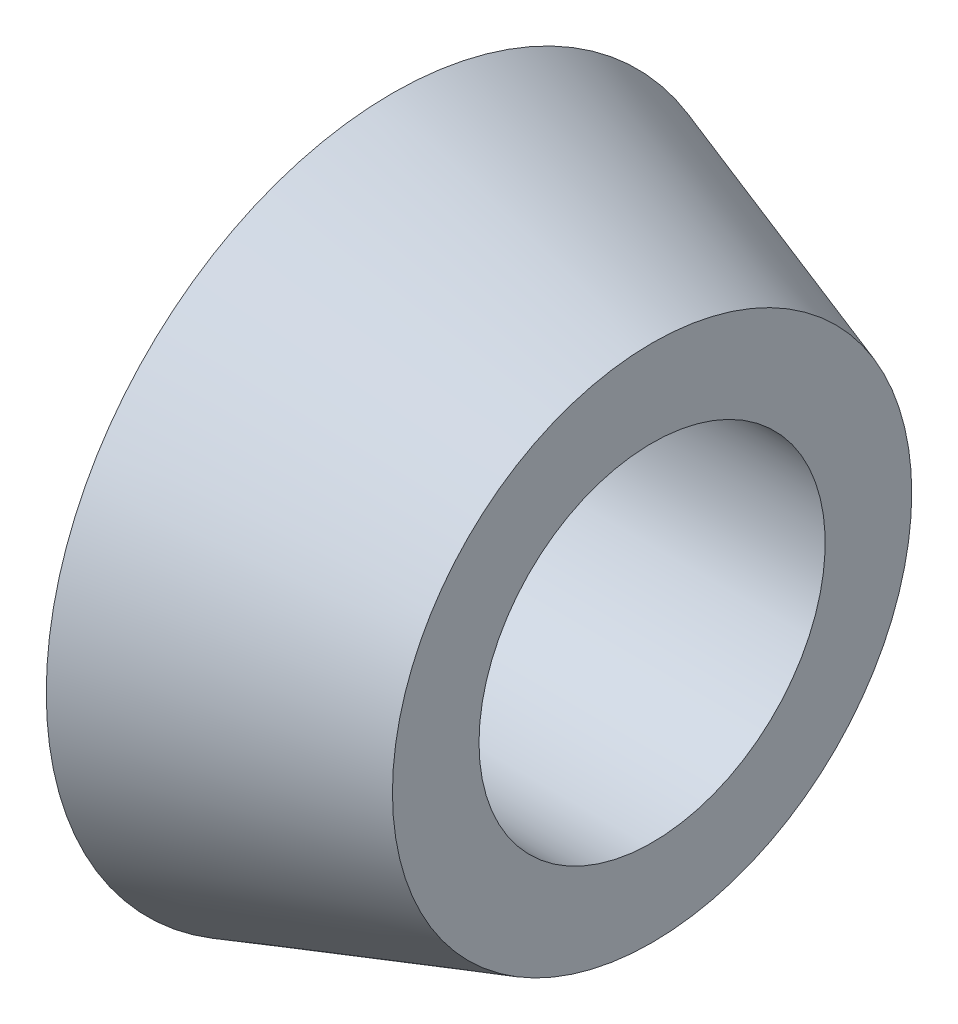
ISO-10303-21;
HEADER;
FILE_DESCRIPTION(('STEP AP214'),'2;1');
FILE_NAME('part.step','',(''),(''),'','','');
FILE_SCHEMA(('AUTOMOTIVE_DESIGN { 1 0 10303 214 1 1 1 1 }'));
ENDSEC;
DATA;
#1=APPLICATION_CONTEXT('core data for automotive mechanical design processes');
#2=APPLICATION_PROTOCOL_DEFINITION('international standard','automotive_design',2000,#1);
#3=PRODUCT_CONTEXT('',#1,'mechanical');
#4=PRODUCT('Part','Part','',(#3));
#5=PRODUCT_RELATED_PRODUCT_CATEGORY('part','',(#4));
#6=PRODUCT_DEFINITION_FORMATION('','',#4);
#7=PRODUCT_DEFINITION_CONTEXT('part definition',#1,'design');
#8=PRODUCT_DEFINITION('design','',#6,#7);
#9=PRODUCT_DEFINITION_SHAPE('','',#8);
#10=(LENGTH_UNIT() NAMED_UNIT(*) SI_UNIT(.MILLI.,.METRE.));
#11=(NAMED_UNIT(*) PLANE_ANGLE_UNIT() SI_UNIT($,.RADIAN.));
#12=(NAMED_UNIT(*) SI_UNIT($,.STERADIAN.) SOLID_ANGLE_UNIT());
#13=UNCERTAINTY_MEASURE_WITH_UNIT(LENGTH_MEASURE(1.E-05),#10,'distance_accuracy_value','');
#14=(GEOMETRIC_REPRESENTATION_CONTEXT(3) GLOBAL_UNCERTAINTY_ASSIGNED_CONTEXT((#13)) GLOBAL_UNIT_ASSIGNED_CONTEXT((#10,
#11,#12)) REPRESENTATION_CONTEXT('',''));
#15=CARTESIAN_POINT('',(0.,0.,0.));
#16=DIRECTION('',(0.,0.,1.));
#17=DIRECTION('',(1.,0.,0.));
#18=AXIS2_PLACEMENT_3D('',#15,#16,#17);
#19=CARTESIAN_POINT('',(0.,6.,0.));
#20=DIRECTION('',(1.,0.,0.));
#21=DIRECTION('',(0.,0.,-1.));
#22=AXIS2_PLACEMENT_3D('',#19,#20,#21);
#23=PLANE('',#22);
#24=CARTESIAN_POINT('',(0.,0.,0.));
#25=DIRECTION('',(-1.,0.,0.));
#26=DIRECTION('',(0.,0.,1.));
#27=AXIS2_PLACEMENT_3D('',#24,#25,#26);
#28=CIRCLE('',#27,3.);
#29=CARTESIAN_POINT('',(0.,0.,3.));
#30=VERTEX_POINT('',#29);
#31=EDGE_CURVE('E10',#30,#30,#28,.T.);
#32=ORIENTED_EDGE('',*,*,#31,.F.);
#33=EDGE_LOOP('',(#32));
#34=FACE_BOUND('',#33,.T.);
#35=CARTESIAN_POINT('',(0.,0.,0.));
#36=DIRECTION('',(-1.,0.,0.));
#37=DIRECTION('',(0.,0.,1.));
#38=AXIS2_PLACEMENT_3D('',#35,#36,#37);
#39=CIRCLE('',#38,6.);
#40=CARTESIAN_POINT('',(0.,0.,6.));
#41=VERTEX_POINT('',#40);
#42=EDGE_CURVE('E48',#41,#41,#39,.T.);
#43=ORIENTED_EDGE('',*,*,#42,.T.);
#44=EDGE_LOOP('',(#43));
#45=FACE_BOUND('',#44,.T.);
#46=ADVANCED_FACE('F34',(#34,#45),#23,.F.);
#47=CARTESIAN_POINT('',(0.,0.,0.));
#48=DIRECTION('',(-1.,0.,0.));
#49=DIRECTION('',(0.,0.,1.));
#50=AXIS2_PLACEMENT_3D('',#47,#48,#49);
#51=CYLINDRICAL_SURFACE('',#50,3.);
#52=CARTESIAN_POINT('',(4.5,0.,0.));
#53=DIRECTION('',(-1.,0.,0.));
#54=DIRECTION('',(0.,0.,1.));
#55=AXIS2_PLACEMENT_3D('',#52,#53,#54);
#56=CIRCLE('',#55,3.);
#57=CARTESIAN_POINT('',(4.5,0.,3.));
#58=VERTEX_POINT('',#57);
#59=EDGE_CURVE('E40',#58,#58,#56,.T.);
#60=ORIENTED_EDGE('',*,*,#59,.F.);
#61=EDGE_LOOP('',(#60));
#62=FACE_BOUND('',#61,.T.);
#63=ORIENTED_EDGE('',*,*,#31,.T.);
#64=EDGE_LOOP('',(#63));
#65=FACE_BOUND('',#64,.T.);
#66=ADVANCED_FACE('F63',(#62,#65),#51,.F.);
#67=CARTESIAN_POINT('',(4.5,3.,0.));
#68=DIRECTION('',(-1.,0.,0.));
#69=DIRECTION('',(0.,0.,1.));
#70=AXIS2_PLACEMENT_3D('',#67,#68,#69);
#71=PLANE('',#70);
#72=CARTESIAN_POINT('',(4.5,0.,0.));
#73=DIRECTION('',(-1.,0.,0.));
#74=DIRECTION('',(0.,0.,1.));
#75=AXIS2_PLACEMENT_3D('',#72,#73,#74);
#76=CIRCLE('',#75,4.5);
#77=CARTESIAN_POINT('',(4.5,0.,4.5));
#78=VERTEX_POINT('',#77);
#79=EDGE_CURVE('E44',#78,#78,#76,.T.);
#80=ORIENTED_EDGE('',*,*,#79,.F.);
#81=EDGE_LOOP('',(#80));
#82=FACE_BOUND('',#81,.T.);
#83=ORIENTED_EDGE('',*,*,#59,.T.);
#84=EDGE_LOOP('',(#83));
#85=FACE_BOUND('',#84,.T.);
#86=ADVANCED_FACE('F58',(#82,#85),#71,.F.);
#87=CARTESIAN_POINT('',(4.5,0.,0.));
#88=DIRECTION('',(-1.,0.,0.));
#89=DIRECTION('',(0.,0.,1.));
#90=AXIS2_PLACEMENT_3D('',#87,#88,#89);
#91=CONICAL_SURFACE('',#90,4.5,0.321750554396642);
#92=ORIENTED_EDGE('',*,*,#42,.F.);
#93=EDGE_LOOP('',(#92));
#94=FACE_BOUND('',#93,.T.);
#95=ORIENTED_EDGE('',*,*,#79,.T.);
#96=EDGE_LOOP('',(#95));
#97=FACE_BOUND('',#96,.T.);
#98=ADVANCED_FACE('F55',(#94,#97),#91,.T.);
#99=CLOSED_SHELL('',(#46,#66,#86,#98));
#100=MANIFOLD_SOLID_BREP('B2',#99);
#101=ADVANCED_BREP_SHAPE_REPRESENTATION('',(#18,#100),#14);
#102=SHAPE_DEFINITION_REPRESENTATION(#9,#101);
ENDSEC;
END-ISO-10303-21;
